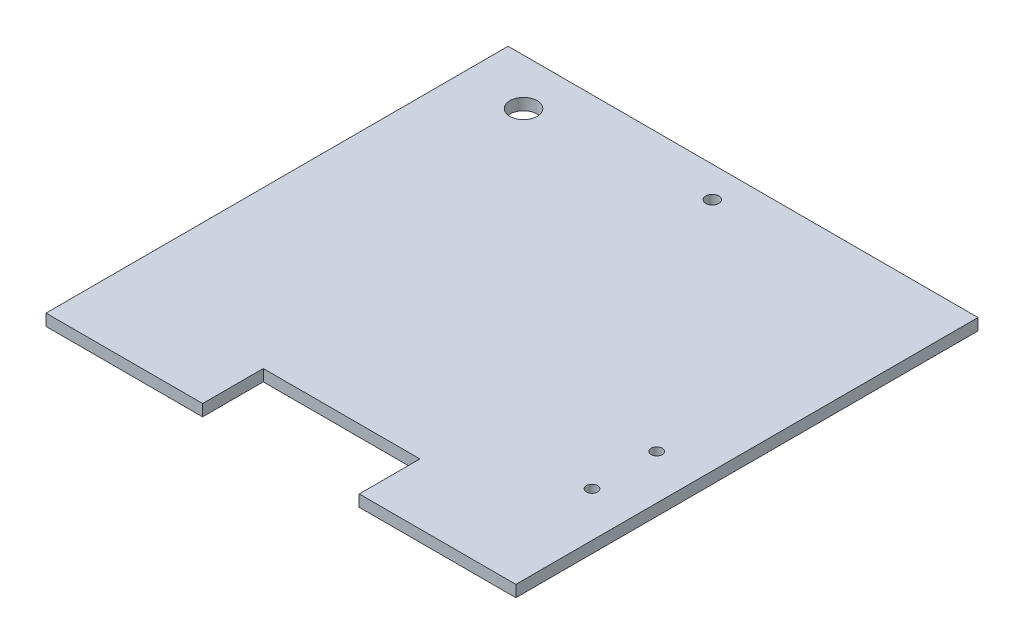
ISO-10303-21;
HEADER;
FILE_DESCRIPTION(('STEP AP214'),'2;1');
FILE_NAME('part.step','',(''),(''),'','','');
FILE_SCHEMA(('AUTOMOTIVE_DESIGN { 1 0 10303 214 1 1 1 1 }'));
ENDSEC;
DATA;
#1=APPLICATION_CONTEXT('core data for automotive mechanical design processes');
#2=APPLICATION_PROTOCOL_DEFINITION('international standard','automotive_design',2000,#1);
#3=PRODUCT_CONTEXT('',#1,'mechanical');
#4=PRODUCT('Part','Part','',(#3));
#5=PRODUCT_RELATED_PRODUCT_CATEGORY('part','',(#4));
#6=PRODUCT_DEFINITION_FORMATION('','',#4);
#7=PRODUCT_DEFINITION_CONTEXT('part definition',#1,'design');
#8=PRODUCT_DEFINITION('design','',#6,#7);
#9=PRODUCT_DEFINITION_SHAPE('','',#8);
#10=(LENGTH_UNIT() NAMED_UNIT(*) SI_UNIT(.MILLI.,.METRE.));
#11=(NAMED_UNIT(*) PLANE_ANGLE_UNIT() SI_UNIT($,.RADIAN.));
#12=(NAMED_UNIT(*) SI_UNIT($,.STERADIAN.) SOLID_ANGLE_UNIT());
#13=UNCERTAINTY_MEASURE_WITH_UNIT(LENGTH_MEASURE(1.E-05),#10,'distance_accuracy_value','');
#14=(GEOMETRIC_REPRESENTATION_CONTEXT(3) GLOBAL_UNCERTAINTY_ASSIGNED_CONTEXT((#13)) GLOBAL_UNIT_ASSIGNED_CONTEXT((#10,
#11,#12)) REPRESENTATION_CONTEXT('',''));
#15=CARTESIAN_POINT('',(0.,0.,0.));
#16=DIRECTION('',(0.,0.,1.));
#17=DIRECTION('',(1.,0.,0.));
#18=AXIS2_PLACEMENT_3D('',#15,#16,#17);
#19=CARTESIAN_POINT('',(-96.84,4.78,95.25));
#20=DIRECTION('',(0.,0.,-1.));
#21=DIRECTION('',(-1.,0.,0.));
#22=AXIS2_PLACEMENT_3D('',#19,#20,#21);
#23=PLANE('',#22);
#24=DIRECTION('',(1.,0.,0.));
#25=VECTOR('',#24,1.);
#26=CARTESIAN_POINT('',(-96.84,0.,95.25));
#27=LINE('',#26,#25);
#28=CARTESIAN_POINT('',(-96.84,0.,95.25));
#29=VERTEX_POINT('',#28);
#30=CARTESIAN_POINT('',(-32.28,0.,95.25));
#31=VERTEX_POINT('',#30);
#32=EDGE_CURVE('E134',#29,#31,#27,.T.);
#33=ORIENTED_EDGE('',*,*,#32,.T.);
#34=DIRECTION('',(0.,1.,0.));
#35=VECTOR('',#34,1.);
#36=CARTESIAN_POINT('',(-32.28,0.,95.25));
#37=LINE('',#36,#35);
#38=CARTESIAN_POINT('',(-32.28,4.78,95.25));
#39=VERTEX_POINT('',#38);
#40=EDGE_CURVE('E165',#31,#39,#37,.T.);
#41=ORIENTED_EDGE('',*,*,#40,.T.);
#42=DIRECTION('',(1.,0.,0.));
#43=VECTOR('',#42,1.);
#44=CARTESIAN_POINT('',(-96.84,4.78,95.25));
#45=LINE('',#44,#43);
#46=CARTESIAN_POINT('',(-96.84,4.78,95.25));
#47=VERTEX_POINT('',#46);
#48=EDGE_CURVE('E149',#47,#39,#45,.T.);
#49=ORIENTED_EDGE('',*,*,#48,.F.);
#50=DIRECTION('',(0.,-1.,0.));
#51=VECTOR('',#50,1.);
#52=CARTESIAN_POINT('',(-96.84,4.78,95.25));
#53=LINE('',#52,#51);
#54=EDGE_CURVE('E148',#47,#29,#53,.T.);
#55=ORIENTED_EDGE('',*,*,#54,.T.);
#56=EDGE_LOOP('',(#33,#41,#49,#55));
#57=FACE_BOUND('',#56,.T.);
#58=ADVANCED_FACE('F39',(#57),#23,.F.);
#59=CARTESIAN_POINT('',(96.84,4.78,95.25));
#60=DIRECTION('',(-1.,0.,0.));
#61=DIRECTION('',(0.,0.,1.));
#62=AXIS2_PLACEMENT_3D('',#59,#60,#61);
#63=PLANE('',#62);
#64=DIRECTION('',(0.,0.,-1.));
#65=VECTOR('',#64,1.);
#66=CARTESIAN_POINT('',(96.84,0.,95.25));
#67=LINE('',#66,#65);
#68=CARTESIAN_POINT('',(96.84,0.,95.25));
#69=VERTEX_POINT('',#68);
#70=CARTESIAN_POINT('',(96.84,0.,-95.25));
#71=VERTEX_POINT('',#70);
#72=EDGE_CURVE('E132',#69,#71,#67,.T.);
#73=ORIENTED_EDGE('',*,*,#72,.T.);
#74=DIRECTION('',(0.,-1.,0.));
#75=VECTOR('',#74,1.);
#76=CARTESIAN_POINT('',(96.84,4.78,-95.25));
#77=LINE('',#76,#75);
#78=CARTESIAN_POINT('',(96.84,4.78,-95.25));
#79=VERTEX_POINT('',#78);
#80=EDGE_CURVE('E11',#79,#71,#77,.T.);
#81=ORIENTED_EDGE('',*,*,#80,.F.);
#82=DIRECTION('',(0.,0.,-1.));
#83=VECTOR('',#82,1.);
#84=CARTESIAN_POINT('',(96.84,4.78,95.25));
#85=LINE('',#84,#83);
#86=CARTESIAN_POINT('',(96.84,4.78,95.25));
#87=VERTEX_POINT('',#86);
#88=EDGE_CURVE('E140',#87,#79,#85,.T.);
#89=ORIENTED_EDGE('',*,*,#88,.F.);
#90=DIRECTION('',(0.,-1.,0.));
#91=VECTOR('',#90,1.);
#92=CARTESIAN_POINT('',(96.84,4.78,95.25));
#93=LINE('',#92,#91);
#94=EDGE_CURVE('E145',#87,#69,#93,.T.);
#95=ORIENTED_EDGE('',*,*,#94,.T.);
#96=EDGE_LOOP('',(#73,#81,#89,#95));
#97=FACE_BOUND('',#96,.T.);
#98=ADVANCED_FACE('F41',(#97),#63,.F.);
#99=CARTESIAN_POINT('',(-96.84,4.78,-95.25));
#100=DIRECTION('',(0.,0.,1.));
#101=DIRECTION('',(1.,0.,0.));
#102=AXIS2_PLACEMENT_3D('',#99,#100,#101);
#103=PLANE('',#102);
#104=DIRECTION('',(-1.,0.,0.));
#105=VECTOR('',#104,1.);
#106=CARTESIAN_POINT('',(-96.84,0.,-95.25));
#107=LINE('',#106,#105);
#108=CARTESIAN_POINT('',(-96.84,0.,-95.25));
#109=VERTEX_POINT('',#108);
#110=EDGE_CURVE('E141',#71,#109,#107,.T.);
#111=ORIENTED_EDGE('',*,*,#110,.T.);
#112=DIRECTION('',(0.,-1.,0.));
#113=VECTOR('',#112,1.);
#114=CARTESIAN_POINT('',(-96.84,4.78,-95.25));
#115=LINE('',#114,#113);
#116=CARTESIAN_POINT('',(-96.84,4.78,-95.25));
#117=VERTEX_POINT('',#116);
#118=EDGE_CURVE('E48',#117,#109,#115,.T.);
#119=ORIENTED_EDGE('',*,*,#118,.F.);
#120=DIRECTION('',(-1.,0.,0.));
#121=VECTOR('',#120,1.);
#122=CARTESIAN_POINT('',(-96.84,4.78,-95.25));
#123=LINE('',#122,#121);
#124=EDGE_CURVE('E93',#79,#117,#123,.T.);
#125=ORIENTED_EDGE('',*,*,#124,.F.);
#126=ORIENTED_EDGE('',*,*,#80,.T.);
#127=EDGE_LOOP('',(#111,#119,#125,#126));
#128=FACE_BOUND('',#127,.T.);
#129=ADVANCED_FACE('F177',(#128),#103,.F.);
#130=CARTESIAN_POINT('',(-96.84,4.78,95.25));
#131=DIRECTION('',(1.,0.,0.));
#132=DIRECTION('',(0.,0.,-1.));
#133=AXIS2_PLACEMENT_3D('',#130,#131,#132);
#134=PLANE('',#133);
#135=DIRECTION('',(0.,0.,1.));
#136=VECTOR('',#135,1.);
#137=CARTESIAN_POINT('',(-96.84,0.,95.25));
#138=LINE('',#137,#136);
#139=EDGE_CURVE('E135',#109,#29,#138,.T.);
#140=ORIENTED_EDGE('',*,*,#139,.T.);
#141=ORIENTED_EDGE('',*,*,#54,.F.);
#142=DIRECTION('',(0.,0.,1.));
#143=VECTOR('',#142,1.);
#144=CARTESIAN_POINT('',(-96.84,4.78,95.25));
#145=LINE('',#144,#143);
#146=EDGE_CURVE('E159',#117,#47,#145,.T.);
#147=ORIENTED_EDGE('',*,*,#146,.F.);
#148=ORIENTED_EDGE('',*,*,#118,.T.);
#149=EDGE_LOOP('',(#140,#141,#147,#148));
#150=FACE_BOUND('',#149,.T.);
#151=ADVANCED_FACE('F157',(#150),#134,.F.);
#152=CARTESIAN_POINT('',(32.28,4.78,95.25));
#153=VERTEX_POINT('',#152);
#154=EDGE_CURVE('E64',#153,#87,#45,.T.);
#155=ORIENTED_EDGE('',*,*,#154,.F.);
#156=DIRECTION('',(0.,1.,0.));
#157=VECTOR('',#156,1.);
#158=CARTESIAN_POINT('',(32.28,0.,95.25));
#159=LINE('',#158,#157);
#160=CARTESIAN_POINT('',(32.28,0.,95.25));
#161=VERTEX_POINT('',#160);
#162=EDGE_CURVE('E117',#161,#153,#159,.T.);
#163=ORIENTED_EDGE('',*,*,#162,.F.);
#164=EDGE_CURVE('E86',#161,#69,#27,.T.);
#165=ORIENTED_EDGE('',*,*,#164,.T.);
#166=ORIENTED_EDGE('',*,*,#94,.F.);
#167=EDGE_LOOP('',(#155,#163,#165,#166));
#168=FACE_BOUND('',#167,.T.);
#169=ADVANCED_FACE('F123',(#168),#23,.F.);
#170=CARTESIAN_POINT('',(0.,4.78,0.));
#171=DIRECTION('',(0.,-1.,0.));
#172=DIRECTION('',(0.,0.,-1.));
#173=AXIS2_PLACEMENT_3D('',#170,#171,#172);
#174=PLANE('',#173);
#175=CARTESIAN_POINT('',(78.425,4.78,45.44099));
#176=DIRECTION('',(0.,1.,0.));
#177=DIRECTION('',(0.,0.,1.));
#178=AXIS2_PLACEMENT_3D('',#175,#176,#177);
#179=CIRCLE('',#178,2.28599999999999);
#180=CARTESIAN_POINT('',(78.425,4.78,47.72699));
#181=VERTEX_POINT('',#180);
#182=EDGE_CURVE('E225',#181,#181,#179,.T.);
#183=ORIENTED_EDGE('',*,*,#182,.F.);
#184=EDGE_LOOP('',(#183));
#185=FACE_BOUND('',#184,.T.);
#186=CARTESIAN_POINT('',(-71.44,4.78,-76.2));
#187=DIRECTION('',(0.,1.,0.));
#188=DIRECTION('',(0.,0.,1.));
#189=AXIS2_PLACEMENT_3D('',#186,#187,#188);
#190=CIRCLE('',#189,5.61339999999999);
#191=CARTESIAN_POINT('',(-71.44,4.78,-70.5866));
#192=VERTEX_POINT('',#191);
#193=EDGE_CURVE('E217',#192,#192,#190,.T.);
#194=ORIENTED_EDGE('',*,*,#193,.F.);
#195=EDGE_LOOP('',(#194));
#196=FACE_BOUND('',#195,.T.);
#197=CARTESIAN_POINT('',(78.425,4.78,18.77099));
#198=DIRECTION('',(0.,1.,0.));
#199=DIRECTION('',(0.,0.,1.));
#200=AXIS2_PLACEMENT_3D('',#197,#198,#199);
#201=CIRCLE('',#200,2.28599999999999);
#202=CARTESIAN_POINT('',(78.425,4.78,21.05699));
#203=VERTEX_POINT('',#202);
#204=EDGE_CURVE('E213',#203,#203,#201,.T.);
#205=ORIENTED_EDGE('',*,*,#204,.F.);
#206=EDGE_LOOP('',(#205));
#207=FACE_BOUND('',#206,.T.);
#208=CARTESIAN_POINT('',(0.,4.78,-82.55));
#209=DIRECTION('',(0.,1.,0.));
#210=DIRECTION('',(0.,0.,1.));
#211=AXIS2_PLACEMENT_3D('',#208,#209,#210);
#212=CIRCLE('',#211,2.6797);
#213=CARTESIAN_POINT('',(0.,4.78,-79.8703));
#214=VERTEX_POINT('',#213);
#215=EDGE_CURVE('E185',#214,#214,#212,.T.);
#216=ORIENTED_EDGE('',*,*,#215,.F.);
#217=EDGE_LOOP('',(#216));
#218=FACE_BOUND('',#217,.T.);
#219=ORIENTED_EDGE('',*,*,#48,.T.);
#220=DIRECTION('',(0.,0.,1.));
#221=VECTOR('',#220,1.);
#222=CARTESIAN_POINT('',(-32.28,4.78,95.25));
#223=LINE('',#222,#221);
#224=CARTESIAN_POINT('',(-32.28,4.78,70.249999962));
#225=VERTEX_POINT('',#224);
#226=EDGE_CURVE('E121',#225,#39,#223,.T.);
#227=ORIENTED_EDGE('',*,*,#226,.F.);
#228=DIRECTION('',(-1.,0.,0.));
#229=VECTOR('',#228,1.);
#230=CARTESIAN_POINT('',(-32.28,4.78,70.249999962));
#231=LINE('',#230,#229);
#232=CARTESIAN_POINT('',(32.28,4.78,70.249999962));
#233=VERTEX_POINT('',#232);
#234=EDGE_CURVE('E201',#233,#225,#231,.T.);
#235=ORIENTED_EDGE('',*,*,#234,.F.);
#236=DIRECTION('',(0.,0.,-1.));
#237=VECTOR('',#236,1.);
#238=CARTESIAN_POINT('',(32.28,4.78,70.249999962));
#239=LINE('',#238,#237);
#240=EDGE_CURVE('E205',#153,#233,#239,.T.);
#241=ORIENTED_EDGE('',*,*,#240,.F.);
#242=ORIENTED_EDGE('',*,*,#154,.T.);
#243=ORIENTED_EDGE('',*,*,#88,.T.);
#244=ORIENTED_EDGE('',*,*,#124,.T.);
#245=ORIENTED_EDGE('',*,*,#146,.T.);
#246=EDGE_LOOP('',(#219,#227,#235,#241,#242,#243,#244,#245));
#247=FACE_BOUND('',#246,.T.);
#248=ADVANCED_FACE('F239',(#185,#196,#207,#218,#247),#174,.F.);
#249=CARTESIAN_POINT('',(0.,0.,0.));
#250=DIRECTION('',(0.,-1.,0.));
#251=DIRECTION('',(0.,0.,-1.));
#252=AXIS2_PLACEMENT_3D('',#249,#250,#251);
#253=PLANE('',#252);
#254=CARTESIAN_POINT('',(78.425,0.,45.44099));
#255=DIRECTION('',(0.,1.,0.));
#256=DIRECTION('',(0.,0.,1.));
#257=AXIS2_PLACEMENT_3D('',#254,#255,#256);
#258=CIRCLE('',#257,2.28599999999999);
#259=CARTESIAN_POINT('',(78.425,0.,47.72699));
#260=VERTEX_POINT('',#259);
#261=EDGE_CURVE('E221',#260,#260,#258,.T.);
#262=ORIENTED_EDGE('',*,*,#261,.T.);
#263=EDGE_LOOP('',(#262));
#264=FACE_BOUND('',#263,.T.);
#265=CARTESIAN_POINT('',(-71.44,0.,-76.2));
#266=DIRECTION('',(0.,1.,0.));
#267=DIRECTION('',(0.,0.,1.));
#268=AXIS2_PLACEMENT_3D('',#265,#266,#267);
#269=CIRCLE('',#268,5.61339999999999);
#270=CARTESIAN_POINT('',(-71.44,0.,-70.5866));
#271=VERTEX_POINT('',#270);
#272=EDGE_CURVE('E229',#271,#271,#269,.T.);
#273=ORIENTED_EDGE('',*,*,#272,.T.);
#274=EDGE_LOOP('',(#273));
#275=FACE_BOUND('',#274,.T.);
#276=CARTESIAN_POINT('',(78.425,0.,18.77099));
#277=DIRECTION('',(0.,1.,0.));
#278=DIRECTION('',(0.,0.,1.));
#279=AXIS2_PLACEMENT_3D('',#276,#277,#278);
#280=CIRCLE('',#279,2.28599999999999);
#281=CARTESIAN_POINT('',(78.425,0.,21.05699));
#282=VERTEX_POINT('',#281);
#283=EDGE_CURVE('E208',#282,#282,#280,.T.);
#284=ORIENTED_EDGE('',*,*,#283,.T.);
#285=EDGE_LOOP('',(#284));
#286=FACE_BOUND('',#285,.T.);
#287=DIRECTION('',(0.,0.,1.));
#288=VECTOR('',#287,1.);
#289=CARTESIAN_POINT('',(-32.28,0.,95.25));
#290=LINE('',#289,#288);
#291=CARTESIAN_POINT('',(-32.28,0.,70.249999962));
#292=VERTEX_POINT('',#291);
#293=EDGE_CURVE('E125',#292,#31,#290,.T.);
#294=ORIENTED_EDGE('',*,*,#293,.T.);
#295=ORIENTED_EDGE('',*,*,#32,.F.);
#296=ORIENTED_EDGE('',*,*,#139,.F.);
#297=ORIENTED_EDGE('',*,*,#110,.F.);
#298=ORIENTED_EDGE('',*,*,#72,.F.);
#299=ORIENTED_EDGE('',*,*,#164,.F.);
#300=DIRECTION('',(0.,0.,-1.));
#301=VECTOR('',#300,1.);
#302=CARTESIAN_POINT('',(32.28,0.,70.249999962));
#303=LINE('',#302,#301);
#304=CARTESIAN_POINT('',(32.28,0.,70.249999962));
#305=VERTEX_POINT('',#304);
#306=EDGE_CURVE('E114',#161,#305,#303,.T.);
#307=ORIENTED_EDGE('',*,*,#306,.T.);
#308=DIRECTION('',(-1.,0.,0.));
#309=VECTOR('',#308,1.);
#310=CARTESIAN_POINT('',(-32.28,0.,70.249999962));
#311=LINE('',#310,#309);
#312=EDGE_CURVE('E55',#305,#292,#311,.T.);
#313=ORIENTED_EDGE('',*,*,#312,.T.);
#314=EDGE_LOOP('',(#294,#295,#296,#297,#298,#299,#307,#313));
#315=FACE_BOUND('',#314,.T.);
#316=CARTESIAN_POINT('',(0.,0.,-82.55));
#317=DIRECTION('',(0.,1.,0.));
#318=DIRECTION('',(0.,0.,1.));
#319=AXIS2_PLACEMENT_3D('',#316,#317,#318);
#320=CIRCLE('',#319,2.6797);
#321=CARTESIAN_POINT('',(0.,0.,-79.8703));
#322=VERTEX_POINT('',#321);
#323=EDGE_CURVE('E175',#322,#322,#320,.T.);
#324=ORIENTED_EDGE('',*,*,#323,.T.);
#325=EDGE_LOOP('',(#324));
#326=FACE_BOUND('',#325,.T.);
#327=ADVANCED_FACE('F129',(#264,#275,#286,#315,#326),#253,.T.);
#328=CARTESIAN_POINT('',(0.,0.,-82.55));
#329=DIRECTION('',(0.,1.,0.));
#330=DIRECTION('',(0.,0.,1.));
#331=AXIS2_PLACEMENT_3D('',#328,#329,#330);
#332=CYLINDRICAL_SURFACE('',#331,2.6797);
#333=ORIENTED_EDGE('',*,*,#323,.F.);
#334=EDGE_LOOP('',(#333));
#335=FACE_BOUND('',#334,.T.);
#336=ORIENTED_EDGE('',*,*,#215,.T.);
#337=EDGE_LOOP('',(#336));
#338=FACE_BOUND('',#337,.T.);
#339=ADVANCED_FACE('F248',(#335,#338),#332,.F.);
#340=CARTESIAN_POINT('',(-32.28,0.,95.25));
#341=DIRECTION('',(-1.,0.,0.));
#342=DIRECTION('',(0.,0.,1.));
#343=AXIS2_PLACEMENT_3D('',#340,#341,#342);
#344=PLANE('',#343);
#345=ORIENTED_EDGE('',*,*,#226,.T.);
#346=ORIENTED_EDGE('',*,*,#40,.F.);
#347=ORIENTED_EDGE('',*,*,#293,.F.);
#348=DIRECTION('',(0.,1.,0.));
#349=VECTOR('',#348,1.);
#350=CARTESIAN_POINT('',(-32.28,0.,70.249999962));
#351=LINE('',#350,#349);
#352=EDGE_CURVE('E194',#292,#225,#351,.T.);
#353=ORIENTED_EDGE('',*,*,#352,.T.);
#354=EDGE_LOOP('',(#345,#346,#347,#353));
#355=FACE_BOUND('',#354,.T.);
#356=ADVANCED_FACE('F250',(#355),#344,.F.);
#357=CARTESIAN_POINT('',(-32.28,0.,70.249999962));
#358=DIRECTION('',(0.,0.,-1.));
#359=DIRECTION('',(-1.,0.,0.));
#360=AXIS2_PLACEMENT_3D('',#357,#358,#359);
#361=PLANE('',#360);
#362=ORIENTED_EDGE('',*,*,#234,.T.);
#363=ORIENTED_EDGE('',*,*,#352,.F.);
#364=ORIENTED_EDGE('',*,*,#312,.F.);
#365=DIRECTION('',(0.,1.,0.));
#366=VECTOR('',#365,1.);
#367=CARTESIAN_POINT('',(32.28,0.,70.249999962));
#368=LINE('',#367,#366);
#369=EDGE_CURVE('E118',#305,#233,#368,.T.);
#370=ORIENTED_EDGE('',*,*,#369,.T.);
#371=EDGE_LOOP('',(#362,#363,#364,#370));
#372=FACE_BOUND('',#371,.T.);
#373=ADVANCED_FACE('F257',(#372),#361,.F.);
#374=CARTESIAN_POINT('',(32.28,0.,70.249999962));
#375=DIRECTION('',(1.,0.,0.));
#376=DIRECTION('',(0.,0.,-1.));
#377=AXIS2_PLACEMENT_3D('',#374,#375,#376);
#378=PLANE('',#377);
#379=ORIENTED_EDGE('',*,*,#240,.T.);
#380=ORIENTED_EDGE('',*,*,#369,.F.);
#381=ORIENTED_EDGE('',*,*,#306,.F.);
#382=ORIENTED_EDGE('',*,*,#162,.T.);
#383=EDGE_LOOP('',(#379,#380,#381,#382));
#384=FACE_BOUND('',#383,.T.);
#385=ADVANCED_FACE('F116',(#384),#378,.F.);
#386=CARTESIAN_POINT('',(78.425,0.,18.77099));
#387=DIRECTION('',(0.,1.,0.));
#388=DIRECTION('',(0.,0.,1.));
#389=AXIS2_PLACEMENT_3D('',#386,#387,#388);
#390=CYLINDRICAL_SURFACE('',#389,2.28599999999999);
#391=ORIENTED_EDGE('',*,*,#283,.F.);
#392=EDGE_LOOP('',(#391));
#393=FACE_BOUND('',#392,.T.);
#394=ORIENTED_EDGE('',*,*,#204,.T.);
#395=EDGE_LOOP('',(#394));
#396=FACE_BOUND('',#395,.T.);
#397=ADVANCED_FACE('F334',(#393,#396),#390,.F.);
#398=CARTESIAN_POINT('',(-71.44,0.,-76.2));
#399=DIRECTION('',(0.,1.,0.));
#400=DIRECTION('',(0.,0.,1.));
#401=AXIS2_PLACEMENT_3D('',#398,#399,#400);
#402=CYLINDRICAL_SURFACE('',#401,5.61339999999999);
#403=ORIENTED_EDGE('',*,*,#272,.F.);
#404=EDGE_LOOP('',(#403));
#405=FACE_BOUND('',#404,.T.);
#406=ORIENTED_EDGE('',*,*,#193,.T.);
#407=EDGE_LOOP('',(#406));
#408=FACE_BOUND('',#407,.T.);
#409=ADVANCED_FACE('F237',(#405,#408),#402,.F.);
#410=CARTESIAN_POINT('',(78.425,0.,45.44099));
#411=DIRECTION('',(0.,1.,0.));
#412=DIRECTION('',(0.,0.,1.));
#413=AXIS2_PLACEMENT_3D('',#410,#411,#412);
#414=CYLINDRICAL_SURFACE('',#413,2.28599999999999);
#415=ORIENTED_EDGE('',*,*,#261,.F.);
#416=EDGE_LOOP('',(#415));
#417=FACE_BOUND('',#416,.T.);
#418=ORIENTED_EDGE('',*,*,#182,.T.);
#419=EDGE_LOOP('',(#418));
#420=FACE_BOUND('',#419,.T.);
#421=ADVANCED_FACE('F348',(#417,#420),#414,.F.);
#422=CLOSED_SHELL('',(#58,#98,#129,#151,#169,#248,#327,#339,#356,#373,#385,#397,#409,#421));
#423=MANIFOLD_SOLID_BREP('B2',#422);
#424=ADVANCED_BREP_SHAPE_REPRESENTATION('',(#18,#423),#14);
#425=SHAPE_DEFINITION_REPRESENTATION(#9,#424);
ENDSEC;
END-ISO-10303-21;
